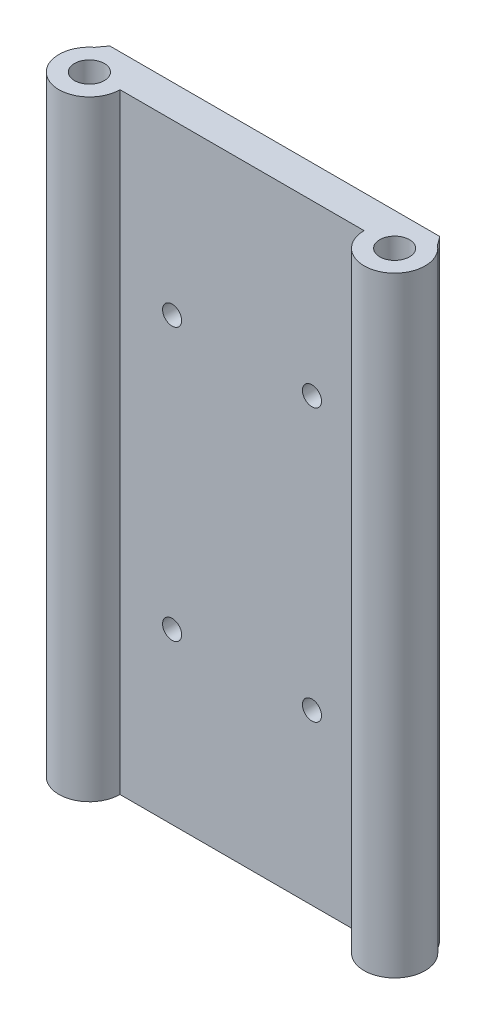
ISO-10303-21;
HEADER;
FILE_DESCRIPTION(('STEP AP214'),'2;1');
FILE_NAME('part.step','',(''),(''),'','','');
FILE_SCHEMA(('AUTOMOTIVE_DESIGN { 1 0 10303 214 1 1 1 1 }'));
ENDSEC;
DATA;
#1=APPLICATION_CONTEXT('core data for automotive mechanical design processes');
#2=APPLICATION_PROTOCOL_DEFINITION('international standard','automotive_design',2000,#1);
#3=PRODUCT_CONTEXT('',#1,'mechanical');
#4=PRODUCT('Part','Part','',(#3));
#5=PRODUCT_RELATED_PRODUCT_CATEGORY('part','',(#4));
#6=PRODUCT_DEFINITION_FORMATION('','',#4);
#7=PRODUCT_DEFINITION_CONTEXT('part definition',#1,'design');
#8=PRODUCT_DEFINITION('design','',#6,#7);
#9=PRODUCT_DEFINITION_SHAPE('','',#8);
#10=(LENGTH_UNIT() NAMED_UNIT(*) SI_UNIT(.MILLI.,.METRE.));
#11=(NAMED_UNIT(*) PLANE_ANGLE_UNIT() SI_UNIT($,.RADIAN.));
#12=(NAMED_UNIT(*) SI_UNIT($,.STERADIAN.) SOLID_ANGLE_UNIT());
#13=UNCERTAINTY_MEASURE_WITH_UNIT(LENGTH_MEASURE(1.E-05),#10,'distance_accuracy_value','');
#14=(GEOMETRIC_REPRESENTATION_CONTEXT(3) GLOBAL_UNCERTAINTY_ASSIGNED_CONTEXT((#13)) GLOBAL_UNIT_ASSIGNED_CONTEXT((#10,
#11,#12)) REPRESENTATION_CONTEXT('',''));
#15=CARTESIAN_POINT('',(0.,0.,0.));
#16=DIRECTION('',(0.,0.,1.));
#17=DIRECTION('',(1.,0.,0.));
#18=AXIS2_PLACEMENT_3D('',#15,#16,#17);
#19=CARTESIAN_POINT('',(-50.8,101.6,0.));
#20=DIRECTION('',(0.,-1.,0.));
#21=DIRECTION('',(0.,0.,-1.));
#22=AXIS2_PLACEMENT_3D('',#19,#20,#21);
#23=CYLINDRICAL_SURFACE('',#22,10.16);
#24=CARTESIAN_POINT('',(-50.8,-101.6,0.));
#25=DIRECTION('',(0.,1.,0.));
#26=DIRECTION('',(0.,0.,1.));
#27=AXIS2_PLACEMENT_3D('',#24,#25,#26);
#28=CIRCLE('',#27,10.16);
#29=CARTESIAN_POINT('',(-57.0241254616946,-101.6,-8.03030897519421));
#30=VERTEX_POINT('',#29);
#31=CARTESIAN_POINT('',(-40.64,-101.6,0.));
#32=VERTEX_POINT('',#31);
#33=EDGE_CURVE('E143',#30,#32,#28,.T.);
#34=ORIENTED_EDGE('',*,*,#33,.T.);
#35=DIRECTION('',(0.,-1.,0.));
#36=VECTOR('',#35,1.);
#37=CARTESIAN_POINT('',(-40.64,101.6,0.));
#38=LINE('',#37,#36);
#39=CARTESIAN_POINT('',(-40.64,101.6,0.));
#40=VERTEX_POINT('',#39);
#41=EDGE_CURVE('E11',#40,#32,#38,.T.);
#42=ORIENTED_EDGE('',*,*,#41,.F.);
#43=CARTESIAN_POINT('',(-50.8,101.6,0.));
#44=DIRECTION('',(0.,1.,0.));
#45=DIRECTION('',(0.,0.,1.));
#46=AXIS2_PLACEMENT_3D('',#43,#44,#45);
#47=CIRCLE('',#46,10.16);
#48=CARTESIAN_POINT('',(-57.0241254616946,101.6,-8.03030897519421));
#49=VERTEX_POINT('',#48);
#50=EDGE_CURVE('E167',#49,#40,#47,.T.);
#51=ORIENTED_EDGE('',*,*,#50,.F.);
#52=DIRECTION('',(0.,-1.,0.));
#53=VECTOR('',#52,1.);
#54=CARTESIAN_POINT('',(-57.0241254616946,101.6,-8.03030897519421));
#55=LINE('',#54,#53);
#56=EDGE_CURVE('E142',#49,#30,#55,.T.);
#57=ORIENTED_EDGE('',*,*,#56,.T.);
#58=EDGE_LOOP('',(#34,#42,#51,#57));
#59=FACE_BOUND('',#58,.T.);
#60=ADVANCED_FACE('F47',(#59),#23,.T.);
#61=CARTESIAN_POINT('',(0.,101.6,0.));
#62=DIRECTION('',(0.,0.,-1.));
#63=DIRECTION('',(-1.,0.,0.));
#64=AXIS2_PLACEMENT_3D('',#61,#62,#63);
#65=PLANE('',#64);
#66=CARTESIAN_POINT('',(-23.2789179251418,-45.2995159624382,0.));
#67=DIRECTION('',(0.,0.,-1.));
#68=DIRECTION('',(-1.,0.,0.));
#69=AXIS2_PLACEMENT_3D('',#66,#67,#68);
#70=CIRCLE('',#69,3.175);
#71=CARTESIAN_POINT('',(-26.4539179251418,-45.2995159624382,0.));
#72=VERTEX_POINT('',#71);
#73=EDGE_CURVE('E148',#72,#72,#70,.T.);
#74=ORIENTED_EDGE('',*,*,#73,.T.);
#75=EDGE_LOOP('',(#74));
#76=FACE_BOUND('',#75,.T.);
#77=CARTESIAN_POINT('',(23.2789179251418,-45.2995159624382,0.));
#78=DIRECTION('',(0.,0.,-1.));
#79=DIRECTION('',(-1.,0.,0.));
#80=AXIS2_PLACEMENT_3D('',#77,#78,#79);
#81=CIRCLE('',#80,3.175);
#82=CARTESIAN_POINT('',(20.1039179251418,-45.2995159624382,0.));
#83=VERTEX_POINT('',#82);
#84=EDGE_CURVE('E186',#83,#83,#81,.T.);
#85=ORIENTED_EDGE('',*,*,#84,.T.);
#86=EDGE_LOOP('',(#85));
#87=FACE_BOUND('',#86,.T.);
#88=CARTESIAN_POINT('',(23.2789179251418,45.2995159624382,0.));
#89=DIRECTION('',(0.,0.,-1.));
#90=DIRECTION('',(-1.,0.,0.));
#91=AXIS2_PLACEMENT_3D('',#88,#89,#90);
#92=CIRCLE('',#91,3.175);
#93=CARTESIAN_POINT('',(20.1039179251418,45.2995159624382,0.));
#94=VERTEX_POINT('',#93);
#95=EDGE_CURVE('E190',#94,#94,#92,.T.);
#96=ORIENTED_EDGE('',*,*,#95,.T.);
#97=EDGE_LOOP('',(#96));
#98=FACE_BOUND('',#97,.T.);
#99=CARTESIAN_POINT('',(-23.2789179251418,45.2995159624382,0.));
#100=DIRECTION('',(0.,0.,-1.));
#101=DIRECTION('',(-1.,0.,0.));
#102=AXIS2_PLACEMENT_3D('',#99,#100,#101);
#103=CIRCLE('',#102,3.175);
#104=CARTESIAN_POINT('',(-26.4539179251418,45.2995159624382,0.));
#105=VERTEX_POINT('',#104);
#106=EDGE_CURVE('E194',#105,#105,#103,.T.);
#107=ORIENTED_EDGE('',*,*,#106,.T.);
#108=EDGE_LOOP('',(#107));
#109=FACE_BOUND('',#108,.T.);
#110=DIRECTION('',(1.,0.,0.));
#111=VECTOR('',#110,1.);
#112=CARTESIAN_POINT('',(0.,-101.6,0.));
#113=LINE('',#112,#111);
#114=CARTESIAN_POINT('',(40.64,-101.6,0.));
#115=VERTEX_POINT('',#114);
#116=EDGE_CURVE('E147',#32,#115,#113,.T.);
#117=ORIENTED_EDGE('',*,*,#116,.T.);
#118=DIRECTION('',(0.,-1.,0.));
#119=VECTOR('',#118,1.);
#120=CARTESIAN_POINT('',(40.64,101.6,0.));
#121=LINE('',#120,#119);
#122=CARTESIAN_POINT('',(40.64,101.6,0.));
#123=VERTEX_POINT('',#122);
#124=EDGE_CURVE('E56',#123,#115,#121,.T.);
#125=ORIENTED_EDGE('',*,*,#124,.F.);
#126=DIRECTION('',(1.,0.,0.));
#127=VECTOR('',#126,1.);
#128=CARTESIAN_POINT('',(0.,101.6,0.));
#129=LINE('',#128,#127);
#130=EDGE_CURVE('E97',#40,#123,#129,.T.);
#131=ORIENTED_EDGE('',*,*,#130,.F.);
#132=ORIENTED_EDGE('',*,*,#41,.T.);
#133=EDGE_LOOP('',(#117,#125,#131,#132));
#134=FACE_BOUND('',#133,.T.);
#135=ADVANCED_FACE('F224',(#76,#87,#98,#109,#134),#65,.F.);
#136=CARTESIAN_POINT('',(50.8,101.6,0.));
#137=DIRECTION('',(0.,-1.,0.));
#138=DIRECTION('',(0.,0.,-1.));
#139=AXIS2_PLACEMENT_3D('',#136,#137,#138);
#140=CYLINDRICAL_SURFACE('',#139,10.16);
#141=CARTESIAN_POINT('',(50.8,-101.6,0.));
#142=DIRECTION('',(0.,1.,0.));
#143=DIRECTION('',(0.,0.,1.));
#144=AXIS2_PLACEMENT_3D('',#141,#142,#143);
#145=CIRCLE('',#144,10.16);
#146=CARTESIAN_POINT('',(57.0241254616946,-101.6,-8.03030897519423));
#147=VERTEX_POINT('',#146);
#148=EDGE_CURVE('E151',#115,#147,#145,.T.);
#149=ORIENTED_EDGE('',*,*,#148,.T.);
#150=DIRECTION('',(0.,-1.,0.));
#151=VECTOR('',#150,1.);
#152=CARTESIAN_POINT('',(57.0241254616946,101.6,-8.03030897519423));
#153=LINE('',#152,#151);
#154=CARTESIAN_POINT('',(57.0241254616946,101.6,-8.03030897519423));
#155=VERTEX_POINT('',#154);
#156=EDGE_CURVE('E126',#155,#147,#153,.T.);
#157=ORIENTED_EDGE('',*,*,#156,.F.);
#158=CARTESIAN_POINT('',(50.8,101.6,0.));
#159=DIRECTION('',(0.,1.,0.));
#160=DIRECTION('',(0.,0.,1.));
#161=AXIS2_PLACEMENT_3D('',#158,#159,#160);
#162=CIRCLE('',#161,10.16);
#163=EDGE_CURVE('E111',#123,#155,#162,.T.);
#164=ORIENTED_EDGE('',*,*,#163,.F.);
#165=ORIENTED_EDGE('',*,*,#124,.T.);
#166=EDGE_LOOP('',(#149,#157,#164,#165));
#167=FACE_BOUND('',#166,.T.);
#168=ADVANCED_FACE('F177',(#167),#140,.T.);
#169=CARTESIAN_POINT('',(0.,101.6,31.7761175748986));
#170=DIRECTION('',(0.,-1.,0.));
#171=DIRECTION('',(0.,0.,-1.));
#172=AXIS2_PLACEMENT_3D('',#169,#170,#171);
#173=CYLINDRICAL_SURFACE('',#172,69.5435293852636);
#174=CARTESIAN_POINT('',(0.,-101.6,31.7761175748986));
#175=DIRECTION('',(0.,1.,0.));
#176=DIRECTION('',(0.,0.,1.));
#177=AXIS2_PLACEMENT_3D('',#174,#175,#176);
#178=CIRCLE('',#177,69.5435293852636);
#179=CARTESIAN_POINT('',(54.8982329464568,-101.6,-10.9144727081555));
#180=VERTEX_POINT('',#179);
#181=EDGE_CURVE('E121',#147,#180,#178,.T.);
#182=ORIENTED_EDGE('',*,*,#181,.T.);
#183=DIRECTION('',(0.,-1.,0.));
#184=VECTOR('',#183,1.);
#185=CARTESIAN_POINT('',(54.8982329464568,101.6,-10.9144727081555));
#186=LINE('',#185,#184);
#187=CARTESIAN_POINT('',(54.8982329464568,101.6,-10.9144727081555));
#188=VERTEX_POINT('',#187);
#189=EDGE_CURVE('E118',#188,#180,#186,.T.);
#190=ORIENTED_EDGE('',*,*,#189,.F.);
#191=CARTESIAN_POINT('',(0.,101.6,31.7761175748986));
#192=DIRECTION('',(0.,1.,0.));
#193=DIRECTION('',(0.,0.,1.));
#194=AXIS2_PLACEMENT_3D('',#191,#192,#193);
#195=CIRCLE('',#194,69.5435293852636);
#196=EDGE_CURVE('E104',#155,#188,#195,.T.);
#197=ORIENTED_EDGE('',*,*,#196,.F.);
#198=ORIENTED_EDGE('',*,*,#156,.T.);
#199=EDGE_LOOP('',(#182,#190,#197,#198));
#200=FACE_BOUND('',#199,.T.);
#201=ADVANCED_FACE('F119',(#200),#173,.T.);
#202=CARTESIAN_POINT('',(0.,101.6,-10.9144727081554));
#203=DIRECTION('',(0.,0.,-1.));
#204=DIRECTION('',(-1.,0.,0.));
#205=AXIS2_PLACEMENT_3D('',#202,#203,#204);
#206=PLANE('',#205);
#207=CARTESIAN_POINT('',(-23.2789179251418,-45.2995159624382,-10.9144727081555));
#208=DIRECTION('',(0.,0.,1.));
#209=DIRECTION('',(-1.,0.,0.));
#210=AXIS2_PLACEMENT_3D('',#207,#208,#209);
#211=CIRCLE('',#210,3.175);
#212=CARTESIAN_POINT('',(-26.4539179251418,-45.2995159624382,-10.9144727081555));
#213=VERTEX_POINT('',#212);
#214=EDGE_CURVE('E210',#213,#213,#211,.T.);
#215=ORIENTED_EDGE('',*,*,#214,.T.);
#216=EDGE_LOOP('',(#215));
#217=FACE_BOUND('',#216,.T.);
#218=CARTESIAN_POINT('',(23.2789179251418,-45.2995159624382,-10.9144727081555));
#219=DIRECTION('',(0.,0.,1.));
#220=DIRECTION('',(-1.,0.,0.));
#221=AXIS2_PLACEMENT_3D('',#218,#219,#220);
#222=CIRCLE('',#221,3.175);
#223=CARTESIAN_POINT('',(20.1039179251418,-45.2995159624382,-10.9144727081555));
#224=VERTEX_POINT('',#223);
#225=EDGE_CURVE('E206',#224,#224,#222,.T.);
#226=ORIENTED_EDGE('',*,*,#225,.T.);
#227=EDGE_LOOP('',(#226));
#228=FACE_BOUND('',#227,.T.);
#229=CARTESIAN_POINT('',(23.2789179251418,45.2995159624382,-10.9144727081555));
#230=DIRECTION('',(0.,0.,1.));
#231=DIRECTION('',(1.,0.,0.));
#232=AXIS2_PLACEMENT_3D('',#229,#230,#231);
#233=CIRCLE('',#232,3.175);
#234=CARTESIAN_POINT('',(26.4539179251418,45.2995159624382,-10.9144727081555));
#235=VERTEX_POINT('',#234);
#236=EDGE_CURVE('E202',#235,#235,#233,.T.);
#237=ORIENTED_EDGE('',*,*,#236,.T.);
#238=EDGE_LOOP('',(#237));
#239=FACE_BOUND('',#238,.T.);
#240=CARTESIAN_POINT('',(-23.2789179251418,45.2995159624382,-10.9144727081555));
#241=DIRECTION('',(0.,0.,1.));
#242=DIRECTION('',(1.,0.,0.));
#243=AXIS2_PLACEMENT_3D('',#240,#241,#242);
#244=CIRCLE('',#243,3.175);
#245=CARTESIAN_POINT('',(-20.1039179251418,45.2995159624382,-10.9144727081555));
#246=VERTEX_POINT('',#245);
#247=EDGE_CURVE('E198',#246,#246,#244,.T.);
#248=ORIENTED_EDGE('',*,*,#247,.T.);
#249=EDGE_LOOP('',(#248));
#250=FACE_BOUND('',#249,.T.);
#251=DIRECTION('',(1.,0.,0.));
#252=VECTOR('',#251,1.);
#253=CARTESIAN_POINT('',(0.,-101.6,-10.9144727081554));
#254=LINE('',#253,#252);
#255=CARTESIAN_POINT('',(-54.8982329464568,-101.6,-10.9144727081554));
#256=VERTEX_POINT('',#255);
#257=EDGE_CURVE('E156',#256,#180,#254,.T.);
#258=ORIENTED_EDGE('',*,*,#257,.F.);
#259=DIRECTION('',(0.,-1.,0.));
#260=VECTOR('',#259,1.);
#261=CARTESIAN_POINT('',(-54.8982329464568,101.6,-10.9144727081554));
#262=LINE('',#261,#260);
#263=CARTESIAN_POINT('',(-54.8982329464568,101.6,-10.9144727081554));
#264=VERTEX_POINT('',#263);
#265=EDGE_CURVE('E86',#264,#256,#262,.T.);
#266=ORIENTED_EDGE('',*,*,#265,.F.);
#267=DIRECTION('',(1.,0.,0.));
#268=VECTOR('',#267,1.);
#269=CARTESIAN_POINT('',(0.,101.6,-10.9144727081554));
#270=LINE('',#269,#268);
#271=EDGE_CURVE('E109',#264,#188,#270,.T.);
#272=ORIENTED_EDGE('',*,*,#271,.T.);
#273=ORIENTED_EDGE('',*,*,#189,.T.);
#274=EDGE_LOOP('',(#258,#266,#272,#273));
#275=FACE_BOUND('',#274,.T.);
#276=ADVANCED_FACE('F128',(#217,#228,#239,#250,#275),#206,.T.);
#277=CARTESIAN_POINT('',(-50.8,101.6,0.));
#278=DIRECTION('',(0.,-1.,0.));
#279=DIRECTION('',(0.,0.,-1.));
#280=AXIS2_PLACEMENT_3D('',#277,#278,#279);
#281=CYLINDRICAL_SURFACE('',#280,4.9609375);
#282=CARTESIAN_POINT('',(-50.8,101.6,0.));
#283=DIRECTION('',(0.,1.,0.));
#284=DIRECTION('',(0.,0.,1.));
#285=AXIS2_PLACEMENT_3D('',#282,#283,#284);
#286=CIRCLE('',#285,4.9609375);
#287=CARTESIAN_POINT('',(-50.8,101.6,4.9609375));
#288=VERTEX_POINT('',#287);
#289=EDGE_CURVE('E132',#288,#288,#286,.T.);
#290=ORIENTED_EDGE('',*,*,#289,.T.);
#291=EDGE_LOOP('',(#290));
#292=FACE_BOUND('',#291,.T.);
#293=CARTESIAN_POINT('',(-50.8,-101.6,0.));
#294=DIRECTION('',(0.,1.,0.));
#295=DIRECTION('',(0.,0.,1.));
#296=AXIS2_PLACEMENT_3D('',#293,#294,#295);
#297=CIRCLE('',#296,4.9609375);
#298=CARTESIAN_POINT('',(-50.8,-101.6,4.9609375));
#299=VERTEX_POINT('',#298);
#300=EDGE_CURVE('E159',#299,#299,#297,.T.);
#301=ORIENTED_EDGE('',*,*,#300,.F.);
#302=EDGE_LOOP('',(#301));
#303=FACE_BOUND('',#302,.T.);
#304=ADVANCED_FACE('F237',(#292,#303),#281,.F.);
#305=EDGE_CURVE('E89',#256,#30,#178,.T.);
#306=ORIENTED_EDGE('',*,*,#305,.T.);
#307=ORIENTED_EDGE('',*,*,#56,.F.);
#308=EDGE_CURVE('E64',#264,#49,#195,.T.);
#309=ORIENTED_EDGE('',*,*,#308,.F.);
#310=ORIENTED_EDGE('',*,*,#265,.T.);
#311=EDGE_LOOP('',(#306,#307,#309,#310));
#312=FACE_BOUND('',#311,.T.);
#313=ADVANCED_FACE('F238',(#312),#173,.T.);
#314=CARTESIAN_POINT('',(50.8,101.6,0.));
#315=DIRECTION('',(0.,-1.,0.));
#316=DIRECTION('',(0.,0.,-1.));
#317=AXIS2_PLACEMENT_3D('',#314,#315,#316);
#318=CYLINDRICAL_SURFACE('',#317,4.9609375);
#319=CARTESIAN_POINT('',(50.8,101.6,0.));
#320=DIRECTION('',(0.,1.,0.));
#321=DIRECTION('',(0.,0.,1.));
#322=AXIS2_PLACEMENT_3D('',#319,#320,#321);
#323=CIRCLE('',#322,4.9609375);
#324=CARTESIAN_POINT('',(50.8,101.6,4.96093749999998));
#325=VERTEX_POINT('',#324);
#326=EDGE_CURVE('E138',#325,#325,#323,.T.);
#327=ORIENTED_EDGE('',*,*,#326,.T.);
#328=EDGE_LOOP('',(#327));
#329=FACE_BOUND('',#328,.T.);
#330=CARTESIAN_POINT('',(50.8,-101.6,0.));
#331=DIRECTION('',(0.,1.,0.));
#332=DIRECTION('',(0.,0.,1.));
#333=AXIS2_PLACEMENT_3D('',#330,#331,#332);
#334=CIRCLE('',#333,4.9609375);
#335=CARTESIAN_POINT('',(50.8,-101.6,4.96093749999998));
#336=VERTEX_POINT('',#335);
#337=EDGE_CURVE('E163',#336,#336,#334,.T.);
#338=ORIENTED_EDGE('',*,*,#337,.F.);
#339=EDGE_LOOP('',(#338));
#340=FACE_BOUND('',#339,.T.);
#341=ADVANCED_FACE('F241',(#329,#340),#318,.F.);
#342=CARTESIAN_POINT('',(0.,101.6,0.));
#343=DIRECTION('',(0.,1.,0.));
#344=DIRECTION('',(0.,0.,1.));
#345=AXIS2_PLACEMENT_3D('',#342,#343,#344);
#346=PLANE('',#345);
#347=ORIENTED_EDGE('',*,*,#50,.T.);
#348=ORIENTED_EDGE('',*,*,#130,.T.);
#349=ORIENTED_EDGE('',*,*,#163,.T.);
#350=ORIENTED_EDGE('',*,*,#196,.T.);
#351=ORIENTED_EDGE('',*,*,#271,.F.);
#352=ORIENTED_EDGE('',*,*,#308,.T.);
#353=EDGE_LOOP('',(#347,#348,#349,#350,#351,#352));
#354=FACE_BOUND('',#353,.T.);
#355=ORIENTED_EDGE('',*,*,#289,.F.);
#356=EDGE_LOOP('',(#355));
#357=FACE_BOUND('',#356,.T.);
#358=ORIENTED_EDGE('',*,*,#326,.F.);
#359=EDGE_LOOP('',(#358));
#360=FACE_BOUND('',#359,.T.);
#361=ADVANCED_FACE('F106',(#354,#357,#360),#346,.T.);
#362=CARTESIAN_POINT('',(0.,-101.6,0.));
#363=DIRECTION('',(0.,1.,0.));
#364=DIRECTION('',(0.,0.,1.));
#365=AXIS2_PLACEMENT_3D('',#362,#363,#364);
#366=PLANE('',#365);
#367=ORIENTED_EDGE('',*,*,#33,.F.);
#368=ORIENTED_EDGE('',*,*,#305,.F.);
#369=ORIENTED_EDGE('',*,*,#257,.T.);
#370=ORIENTED_EDGE('',*,*,#181,.F.);
#371=ORIENTED_EDGE('',*,*,#148,.F.);
#372=ORIENTED_EDGE('',*,*,#116,.F.);
#373=EDGE_LOOP('',(#367,#368,#369,#370,#371,#372));
#374=FACE_BOUND('',#373,.T.);
#375=ORIENTED_EDGE('',*,*,#300,.T.);
#376=EDGE_LOOP('',(#375));
#377=FACE_BOUND('',#376,.T.);
#378=ORIENTED_EDGE('',*,*,#337,.T.);
#379=EDGE_LOOP('',(#378));
#380=FACE_BOUND('',#379,.T.);
#381=ADVANCED_FACE('F180',(#374,#377,#380),#366,.F.);
#382=CARTESIAN_POINT('',(-23.2789179251418,45.2995159624382,-10.9144727081555));
#383=DIRECTION('',(0.,0.,1.));
#384=DIRECTION('',(1.,0.,0.));
#385=AXIS2_PLACEMENT_3D('',#382,#383,#384);
#386=CYLINDRICAL_SURFACE('',#385,3.175);
#387=ORIENTED_EDGE('',*,*,#247,.F.);
#388=EDGE_LOOP('',(#387));
#389=FACE_BOUND('',#388,.T.);
#390=ORIENTED_EDGE('',*,*,#106,.F.);
#391=EDGE_LOOP('',(#390));
#392=FACE_BOUND('',#391,.T.);
#393=ADVANCED_FACE('F249',(#389,#392),#386,.F.);
#394=CARTESIAN_POINT('',(23.2789179251418,45.2995159624382,-10.9144727081555));
#395=DIRECTION('',(0.,0.,1.));
#396=DIRECTION('',(1.,0.,0.));
#397=AXIS2_PLACEMENT_3D('',#394,#395,#396);
#398=CYLINDRICAL_SURFACE('',#397,3.175);
#399=ORIENTED_EDGE('',*,*,#236,.F.);
#400=EDGE_LOOP('',(#399));
#401=FACE_BOUND('',#400,.T.);
#402=ORIENTED_EDGE('',*,*,#95,.F.);
#403=EDGE_LOOP('',(#402));
#404=FACE_BOUND('',#403,.T.);
#405=ADVANCED_FACE('F254',(#401,#404),#398,.F.);
#406=CARTESIAN_POINT('',(23.2789179251418,-45.2995159624382,-10.9144727081555));
#407=DIRECTION('',(0.,0.,1.));
#408=DIRECTION('',(1.,0.,0.));
#409=AXIS2_PLACEMENT_3D('',#406,#407,#408);
#410=CYLINDRICAL_SURFACE('',#409,3.175);
#411=ORIENTED_EDGE('',*,*,#225,.F.);
#412=EDGE_LOOP('',(#411));
#413=FACE_BOUND('',#412,.T.);
#414=ORIENTED_EDGE('',*,*,#84,.F.);
#415=EDGE_LOOP('',(#414));
#416=FACE_BOUND('',#415,.T.);
#417=ADVANCED_FACE('F259',(#413,#416),#410,.F.);
#418=CARTESIAN_POINT('',(-23.2789179251418,-45.2995159624382,-10.9144727081555));
#419=DIRECTION('',(0.,0.,1.));
#420=DIRECTION('',(1.,0.,0.));
#421=AXIS2_PLACEMENT_3D('',#418,#419,#420);
#422=CYLINDRICAL_SURFACE('',#421,3.175);
#423=ORIENTED_EDGE('',*,*,#214,.F.);
#424=EDGE_LOOP('',(#423));
#425=FACE_BOUND('',#424,.T.);
#426=ORIENTED_EDGE('',*,*,#73,.F.);
#427=EDGE_LOOP('',(#426));
#428=FACE_BOUND('',#427,.T.);
#429=ADVANCED_FACE('F256',(#425,#428),#422,.F.);
#430=CLOSED_SHELL('',(#60,#135,#168,#201,#276,#304,#313,#341,#361,#381,#393,#405,#417,#429));
#431=MANIFOLD_SOLID_BREP('B2',#430);
#432=ADVANCED_BREP_SHAPE_REPRESENTATION('',(#18,#431),#14);
#433=SHAPE_DEFINITION_REPRESENTATION(#9,#432);
ENDSEC;
END-ISO-10303-21;
